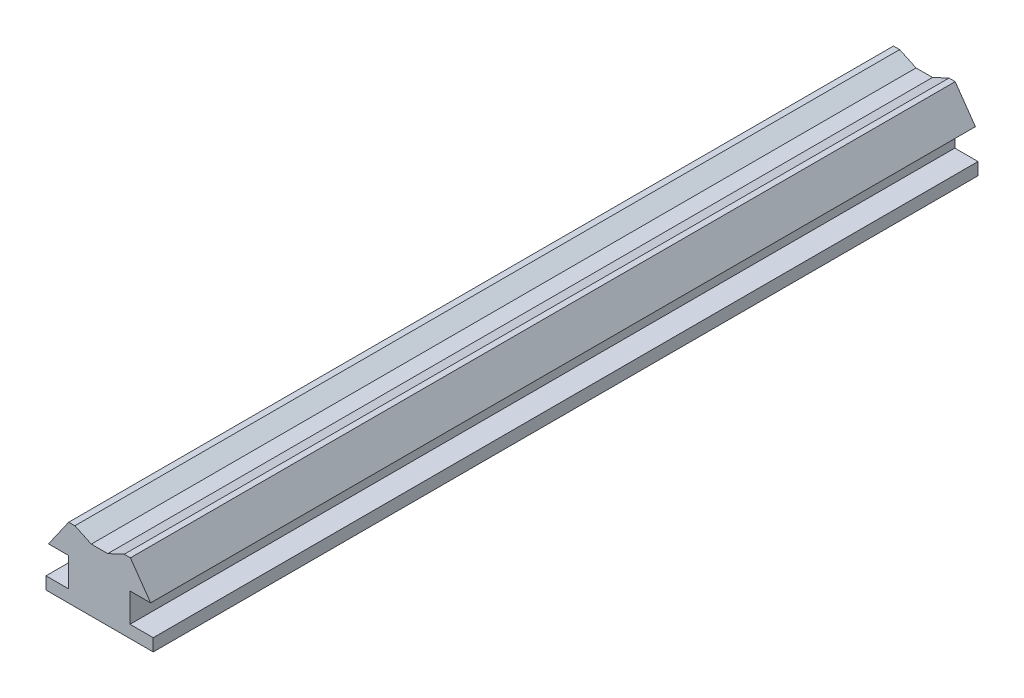
ISO-10303-21;
HEADER;
FILE_DESCRIPTION(('STEP AP214'),'2;1');
FILE_NAME('part.step','',(''),(''),'','','');
FILE_SCHEMA(('AUTOMOTIVE_DESIGN { 1 0 10303 214 1 1 1 1 }'));
ENDSEC;
DATA;
#1=APPLICATION_CONTEXT('core data for automotive mechanical design processes');
#2=APPLICATION_PROTOCOL_DEFINITION('international standard','automotive_design',2000,#1);
#3=PRODUCT_CONTEXT('',#1,'mechanical');
#4=PRODUCT('Part','Part','',(#3));
#5=PRODUCT_RELATED_PRODUCT_CATEGORY('part','',(#4));
#6=PRODUCT_DEFINITION_FORMATION('','',#4);
#7=PRODUCT_DEFINITION_CONTEXT('part definition',#1,'design');
#8=PRODUCT_DEFINITION('design','',#6,#7);
#9=PRODUCT_DEFINITION_SHAPE('','',#8);
#10=(LENGTH_UNIT() NAMED_UNIT(*) SI_UNIT(.MILLI.,.METRE.));
#11=(NAMED_UNIT(*) PLANE_ANGLE_UNIT() SI_UNIT($,.RADIAN.));
#12=(NAMED_UNIT(*) SI_UNIT($,.STERADIAN.) SOLID_ANGLE_UNIT());
#13=UNCERTAINTY_MEASURE_WITH_UNIT(LENGTH_MEASURE(1.E-05),#10,'distance_accuracy_value','');
#14=(GEOMETRIC_REPRESENTATION_CONTEXT(3) GLOBAL_UNCERTAINTY_ASSIGNED_CONTEXT((#13)) GLOBAL_UNIT_ASSIGNED_CONTEXT((#10,
#11,#12)) REPRESENTATION_CONTEXT('',''));
#15=CARTESIAN_POINT('',(0.,0.,0.));
#16=DIRECTION('',(0.,0.,1.));
#17=DIRECTION('',(1.,0.,0.));
#18=AXIS2_PLACEMENT_3D('',#15,#16,#17);
#19=CARTESIAN_POINT('',(0.,-80.3447728525308,2000.));
#20=DIRECTION('',(0.,1.,0.));
#21=DIRECTION('',(0.,0.,1.));
#22=AXIS2_PLACEMENT_3D('',#19,#20,#21);
#23=PLANE('',#22);
#24=DIRECTION('',(1.,0.,0.));
#25=VECTOR('',#24,1.);
#26=CARTESIAN_POINT('',(0.,-80.3447728525308,0.));
#27=LINE('',#26,#25);
#28=CARTESIAN_POINT('',(-160.050058891084,-80.3447728525308,0.));
#29=VERTEX_POINT('',#28);
#30=CARTESIAN_POINT('',(99.9499411089158,-80.3447728525308,0.));
#31=VERTEX_POINT('',#30);
#32=EDGE_CURVE('E177',#29,#31,#27,.T.);
#33=ORIENTED_EDGE('',*,*,#32,.T.);
#34=DIRECTION('',(0.,0.,-1.));
#35=VECTOR('',#34,1.);
#36=CARTESIAN_POINT('',(99.9499411089158,-80.3447728525308,2000.));
#37=LINE('',#36,#35);
#38=CARTESIAN_POINT('',(99.9499411089158,-80.3447728525308,2000.));
#39=VERTEX_POINT('',#38);
#40=EDGE_CURVE('E11',#39,#31,#37,.T.);
#41=ORIENTED_EDGE('',*,*,#40,.F.);
#42=DIRECTION('',(1.,0.,0.));
#43=VECTOR('',#42,1.);
#44=CARTESIAN_POINT('',(0.,-80.3447728525308,2000.));
#45=LINE('',#44,#43);
#46=CARTESIAN_POINT('',(-160.050058891084,-80.3447728525308,2000.));
#47=VERTEX_POINT('',#46);
#48=EDGE_CURVE('E113',#47,#39,#45,.T.);
#49=ORIENTED_EDGE('',*,*,#48,.F.);
#50=DIRECTION('',(0.,0.,-1.));
#51=VECTOR('',#50,1.);
#52=CARTESIAN_POINT('',(-160.050058891084,-80.3447728525308,2000.));
#53=LINE('',#52,#51);
#54=EDGE_CURVE('E173',#47,#29,#53,.T.);
#55=ORIENTED_EDGE('',*,*,#54,.T.);
#56=EDGE_LOOP('',(#33,#41,#49,#55));
#57=FACE_BOUND('',#56,.T.);
#58=ADVANCED_FACE('F33',(#57),#23,.F.);
#59=CARTESIAN_POINT('',(99.9499411089158,0.,2000.));
#60=DIRECTION('',(1.,0.,0.));
#61=DIRECTION('',(0.,1.,0.));
#62=AXIS2_PLACEMENT_3D('',#59,#60,#61);
#63=PLANE('',#62);
#64=DIRECTION('',(0.,-1.,0.));
#65=VECTOR('',#64,1.);
#66=CARTESIAN_POINT('',(99.9499411089158,0.,0.));
#67=LINE('',#66,#65);
#68=CARTESIAN_POINT('',(99.9499411089158,-50.3447728525308,0.));
#69=VERTEX_POINT('',#68);
#70=EDGE_CURVE('E180',#69,#31,#67,.T.);
#71=ORIENTED_EDGE('',*,*,#70,.F.);
#72=DIRECTION('',(0.,0.,-1.));
#73=VECTOR('',#72,1.);
#74=CARTESIAN_POINT('',(99.9499411089158,-50.3447728525308,2000.));
#75=LINE('',#74,#73);
#76=CARTESIAN_POINT('',(99.9499411089158,-50.3447728525308,2000.));
#77=VERTEX_POINT('',#76);
#78=EDGE_CURVE('E41',#77,#69,#75,.T.);
#79=ORIENTED_EDGE('',*,*,#78,.F.);
#80=DIRECTION('',(0.,-1.,0.));
#81=VECTOR('',#80,1.);
#82=CARTESIAN_POINT('',(99.9499411089158,0.,2000.));
#83=LINE('',#82,#81);
#84=EDGE_CURVE('E262',#77,#39,#83,.T.);
#85=ORIENTED_EDGE('',*,*,#84,.T.);
#86=ORIENTED_EDGE('',*,*,#40,.T.);
#87=EDGE_LOOP('',(#71,#79,#85,#86));
#88=FACE_BOUND('',#87,.T.);
#89=ADVANCED_FACE('F249',(#88),#63,.T.);
#90=CARTESIAN_POINT('',(0.,-50.3447728525308,2000.));
#91=DIRECTION('',(0.,1.,0.));
#92=DIRECTION('',(0.,0.,1.));
#93=AXIS2_PLACEMENT_3D('',#90,#91,#92);
#94=PLANE('',#93);
#95=DIRECTION('',(1.,0.,0.));
#96=VECTOR('',#95,1.);
#97=CARTESIAN_POINT('',(0.,-50.3447728525308,0.));
#98=LINE('',#97,#96);
#99=CARTESIAN_POINT('',(43.6687964336795,-50.3447728525308,0.));
#100=VERTEX_POINT('',#99);
#101=EDGE_CURVE('E183',#100,#69,#98,.T.);
#102=ORIENTED_EDGE('',*,*,#101,.F.);
#103=DIRECTION('',(0.,0.,-1.));
#104=VECTOR('',#103,1.);
#105=CARTESIAN_POINT('',(43.6687964336795,-50.3447728525308,2000.));
#106=LINE('',#105,#104);
#107=CARTESIAN_POINT('',(43.6687964336795,-50.3447728525308,2000.));
#108=VERTEX_POINT('',#107);
#109=EDGE_CURVE('E239',#108,#100,#106,.T.);
#110=ORIENTED_EDGE('',*,*,#109,.F.);
#111=DIRECTION('',(1.,0.,0.));
#112=VECTOR('',#111,1.);
#113=CARTESIAN_POINT('',(0.,-50.3447728525308,2000.));
#114=LINE('',#113,#112);
#115=EDGE_CURVE('E246',#108,#77,#114,.T.);
#116=ORIENTED_EDGE('',*,*,#115,.T.);
#117=ORIENTED_EDGE('',*,*,#78,.T.);
#118=EDGE_LOOP('',(#102,#110,#116,#117));
#119=FACE_BOUND('',#118,.T.);
#120=ADVANCED_FACE('F244',(#119),#94,.T.);
#121=CARTESIAN_POINT('',(43.6687964336795,0.,2000.));
#122=DIRECTION('',(1.,0.,0.));
#123=DIRECTION('',(0.,1.,0.));
#124=AXIS2_PLACEMENT_3D('',#121,#122,#123);
#125=PLANE('',#124);
#126=DIRECTION('',(0.,-1.,0.));
#127=VECTOR('',#126,1.);
#128=CARTESIAN_POINT('',(43.6687964336795,0.,0.));
#129=LINE('',#128,#127);
#130=CARTESIAN_POINT('',(43.6687964336795,19.6552271474692,0.));
#131=VERTEX_POINT('',#130);
#132=EDGE_CURVE('E186',#131,#100,#129,.T.);
#133=ORIENTED_EDGE('',*,*,#132,.F.);
#134=DIRECTION('',(0.,0.,-1.));
#135=VECTOR('',#134,1.);
#136=CARTESIAN_POINT('',(43.6687964336795,19.6552271474692,2000.));
#137=LINE('',#136,#135);
#138=CARTESIAN_POINT('',(43.6687964336795,19.6552271474692,2000.));
#139=VERTEX_POINT('',#138);
#140=EDGE_CURVE('E237',#139,#131,#137,.T.);
#141=ORIENTED_EDGE('',*,*,#140,.F.);
#142=DIRECTION('',(0.,-1.,0.));
#143=VECTOR('',#142,1.);
#144=CARTESIAN_POINT('',(43.6687964336795,0.,2000.));
#145=LINE('',#144,#143);
#146=EDGE_CURVE('E259',#139,#108,#145,.T.);
#147=ORIENTED_EDGE('',*,*,#146,.T.);
#148=ORIENTED_EDGE('',*,*,#109,.T.);
#149=EDGE_LOOP('',(#133,#141,#147,#148));
#150=FACE_BOUND('',#149,.T.);
#151=ADVANCED_FACE('F256',(#150),#125,.T.);
#152=CARTESIAN_POINT('',(0.,19.6552271474692,2000.));
#153=DIRECTION('',(0.,-1.,0.));
#154=DIRECTION('',(1.,0.,0.));
#155=AXIS2_PLACEMENT_3D('',#152,#153,#154);
#156=PLANE('',#155);
#157=DIRECTION('',(-1.,0.,0.));
#158=VECTOR('',#157,1.);
#159=CARTESIAN_POINT('',(0.,19.6552271474692,0.));
#160=LINE('',#159,#158);
#161=CARTESIAN_POINT('',(93.6687964336795,19.6552271474692,0.));
#162=VERTEX_POINT('',#161);
#163=EDGE_CURVE('E189',#162,#131,#160,.T.);
#164=ORIENTED_EDGE('',*,*,#163,.F.);
#165=DIRECTION('',(0.,0.,-1.));
#166=VECTOR('',#165,1.);
#167=CARTESIAN_POINT('',(93.6687964336795,19.6552271474692,2000.));
#168=LINE('',#167,#166);
#169=CARTESIAN_POINT('',(93.6687964336795,19.6552271474692,2000.));
#170=VERTEX_POINT('',#169);
#171=EDGE_CURVE('E235',#170,#162,#168,.T.);
#172=ORIENTED_EDGE('',*,*,#171,.F.);
#173=DIRECTION('',(-1.,0.,0.));
#174=VECTOR('',#173,1.);
#175=CARTESIAN_POINT('',(0.,19.6552271474692,2000.));
#176=LINE('',#175,#174);
#177=EDGE_CURVE('E264',#170,#139,#176,.T.);
#178=ORIENTED_EDGE('',*,*,#177,.T.);
#179=ORIENTED_EDGE('',*,*,#140,.T.);
#180=EDGE_LOOP('',(#164,#172,#178,#179));
#181=FACE_BOUND('',#180,.T.);
#182=ADVANCED_FACE('F419',(#181),#156,.T.);
#183=CARTESIAN_POINT('',(72.0876417627088,50.4763101740096,2000.));
#184=DIRECTION('',(0.819152044288993,0.573576436351044,0.));
#185=DIRECTION('',(-0.573576436351044,0.819152044288993,0.));
#186=AXIS2_PLACEMENT_3D('',#183,#184,#185);
#187=PLANE('',#186);
#188=DIRECTION('',(0.573576436351044,-0.819152044288993,0.));
#189=VECTOR('',#188,1.);
#190=CARTESIAN_POINT('',(72.0876417627088,50.4763101740096,0.));
#191=LINE('',#190,#189);
#192=CARTESIAN_POINT('',(44.6058028039926,89.724443704508,0.));
#193=VERTEX_POINT('',#192);
#194=EDGE_CURVE('E192',#193,#162,#191,.T.);
#195=ORIENTED_EDGE('',*,*,#194,.F.);
#196=DIRECTION('',(0.,0.,-1.));
#197=VECTOR('',#196,1.);
#198=CARTESIAN_POINT('',(44.6058028039926,89.724443704508,2000.));
#199=LINE('',#198,#197);
#200=CARTESIAN_POINT('',(44.6058028039926,89.724443704508,2000.));
#201=VERTEX_POINT('',#200);
#202=EDGE_CURVE('E233',#201,#193,#199,.T.);
#203=ORIENTED_EDGE('',*,*,#202,.F.);
#204=DIRECTION('',(0.573576436351044,-0.819152044288993,0.));
#205=VECTOR('',#204,1.);
#206=CARTESIAN_POINT('',(72.0876417627088,50.4763101740096,2000.));
#207=LINE('',#206,#205);
#208=EDGE_CURVE('E270',#201,#170,#207,.T.);
#209=ORIENTED_EDGE('',*,*,#208,.T.);
#210=ORIENTED_EDGE('',*,*,#171,.T.);
#211=EDGE_LOOP('',(#195,#203,#209,#210));
#212=FACE_BOUND('',#211,.T.);
#213=ADVANCED_FACE('F409',(#212),#187,.T.);
#214=CARTESIAN_POINT('',(0.,89.7244437045081,2000.));
#215=DIRECTION('',(0.,1.,0.));
#216=DIRECTION('',(-1.,0.,0.));
#217=AXIS2_PLACEMENT_3D('',#214,#215,#216);
#218=PLANE('',#217);
#219=DIRECTION('',(1.,0.,0.));
#220=VECTOR('',#219,1.);
#221=CARTESIAN_POINT('',(0.,89.7244437045081,0.));
#222=LINE('',#221,#220);
#223=CARTESIAN_POINT('',(29.6058028039926,89.724443704508,0.));
#224=VERTEX_POINT('',#223);
#225=EDGE_CURVE('E195',#224,#193,#222,.T.);
#226=ORIENTED_EDGE('',*,*,#225,.F.);
#227=DIRECTION('',(0.,0.,-1.));
#228=VECTOR('',#227,1.);
#229=CARTESIAN_POINT('',(29.6058028039926,89.724443704508,2000.));
#230=LINE('',#229,#228);
#231=CARTESIAN_POINT('',(29.6058028039926,89.724443704508,2000.));
#232=VERTEX_POINT('',#231);
#233=EDGE_CURVE('E231',#232,#224,#230,.T.);
#234=ORIENTED_EDGE('',*,*,#233,.F.);
#235=DIRECTION('',(1.,0.,0.));
#236=VECTOR('',#235,1.);
#237=CARTESIAN_POINT('',(0.,89.7244437045081,2000.));
#238=LINE('',#237,#236);
#239=EDGE_CURVE('E273',#232,#201,#238,.T.);
#240=ORIENTED_EDGE('',*,*,#239,.T.);
#241=ORIENTED_EDGE('',*,*,#202,.T.);
#242=EDGE_LOOP('',(#226,#234,#240,#241));
#243=FACE_BOUND('',#242,.T.);
#244=ADVANCED_FACE('F399',(#243),#218,.T.);
#245=CARTESIAN_POINT('',(-29.0786759625082,62.3594218408548,2000.));
#246=DIRECTION('',(0.422618261740694,-0.906307787036653,0.));
#247=DIRECTION('',(0.906307787036653,0.422618261740694,0.));
#248=AXIS2_PLACEMENT_3D('',#245,#246,#247);
#249=PLANE('',#248);
#250=DIRECTION('',(-0.906307787036653,-0.422618261740694,0.));
#251=VECTOR('',#250,1.);
#252=CARTESIAN_POINT('',(-29.0786759625082,62.3594218408548,0.));
#253=LINE('',#252,#251);
#254=CARTESIAN_POINT('',(-10.290144877016,71.1206577715029,0.));
#255=VERTEX_POINT('',#254);
#256=EDGE_CURVE('E198',#224,#255,#253,.T.);
#257=ORIENTED_EDGE('',*,*,#256,.T.);
#258=DIRECTION('',(0.,0.,-1.));
#259=VECTOR('',#258,1.);
#260=CARTESIAN_POINT('',(-10.290144877016,71.1206577715029,2000.));
#261=LINE('',#260,#259);
#262=CARTESIAN_POINT('',(-10.290144877016,71.1206577715029,2000.));
#263=VERTEX_POINT('',#262);
#264=EDGE_CURVE('E229',#263,#255,#261,.T.);
#265=ORIENTED_EDGE('',*,*,#264,.F.);
#266=DIRECTION('',(-0.906307787036653,-0.422618261740694,0.));
#267=VECTOR('',#266,1.);
#268=CARTESIAN_POINT('',(-29.0786759625082,62.3594218408548,2000.));
#269=LINE('',#268,#267);
#270=EDGE_CURVE('E276',#232,#263,#269,.T.);
#271=ORIENTED_EDGE('',*,*,#270,.F.);
#272=ORIENTED_EDGE('',*,*,#233,.T.);
#273=EDGE_LOOP('',(#257,#265,#271,#272));
#274=FACE_BOUND('',#273,.T.);
#275=ADVANCED_FACE('F389',(#274),#249,.F.);
#276=CARTESIAN_POINT('',(0.,71.1206577715029,2000.));
#277=DIRECTION('',(0.,1.,0.));
#278=DIRECTION('',(0.,0.,1.));
#279=AXIS2_PLACEMENT_3D('',#276,#277,#278);
#280=PLANE('',#279);
#281=DIRECTION('',(1.,0.,0.));
#282=VECTOR('',#281,1.);
#283=CARTESIAN_POINT('',(0.,71.1206577715029,0.));
#284=LINE('',#283,#282);
#285=CARTESIAN_POINT('',(-50.2221280435459,71.1206577715029,0.));
#286=VERTEX_POINT('',#285);
#287=EDGE_CURVE('E201',#286,#255,#284,.T.);
#288=ORIENTED_EDGE('',*,*,#287,.F.);
#289=DIRECTION('',(0.,0.,-1.));
#290=VECTOR('',#289,1.);
#291=CARTESIAN_POINT('',(-50.2221280435459,71.1206577715029,2000.));
#292=LINE('',#291,#290);
#293=CARTESIAN_POINT('',(-50.2221280435459,71.1206577715029,2000.));
#294=VERTEX_POINT('',#293);
#295=EDGE_CURVE('E227',#294,#286,#292,.T.);
#296=ORIENTED_EDGE('',*,*,#295,.F.);
#297=DIRECTION('',(1.,0.,0.));
#298=VECTOR('',#297,1.);
#299=CARTESIAN_POINT('',(0.,71.1206577715029,2000.));
#300=LINE('',#299,#298);
#301=EDGE_CURVE('E278',#294,#263,#300,.T.);
#302=ORIENTED_EDGE('',*,*,#301,.T.);
#303=ORIENTED_EDGE('',*,*,#264,.T.);
#304=EDGE_LOOP('',(#288,#296,#302,#303));
#305=FACE_BOUND('',#304,.T.);
#306=ADVANCED_FACE('F379',(#305),#280,.T.);
#307=CARTESIAN_POINT('',(18.2708091358813,39.1818766352067,2000.));
#308=DIRECTION('',(0.4226182617407,0.90630778703665,0.));
#309=DIRECTION('',(-0.90630778703665,0.4226182617407,0.));
#310=AXIS2_PLACEMENT_3D('',#307,#308,#309);
#311=PLANE('',#310);
#312=DIRECTION('',(0.90630778703665,-0.4226182617407,0.));
#313=VECTOR('',#312,1.);
#314=CARTESIAN_POINT('',(18.2708091358813,39.1818766352067,0.));
#315=LINE('',#314,#313);
#316=CARTESIAN_POINT('',(-90.0500588910842,89.6927269341778,0.));
#317=VERTEX_POINT('',#316);
#318=EDGE_CURVE('E204',#317,#286,#315,.T.);
#319=ORIENTED_EDGE('',*,*,#318,.F.);
#320=DIRECTION('',(0.,0.,-1.));
#321=VECTOR('',#320,1.);
#322=CARTESIAN_POINT('',(-90.0500588910842,89.6927269341778,2000.));
#323=LINE('',#322,#321);
#324=CARTESIAN_POINT('',(-90.0500588910842,89.6927269341778,2000.));
#325=VERTEX_POINT('',#324);
#326=EDGE_CURVE('E225',#325,#317,#323,.T.);
#327=ORIENTED_EDGE('',*,*,#326,.F.);
#328=DIRECTION('',(0.90630778703665,-0.4226182617407,0.));
#329=VECTOR('',#328,1.);
#330=CARTESIAN_POINT('',(18.2708091358813,39.1818766352067,2000.));
#331=LINE('',#330,#329);
#332=EDGE_CURVE('E281',#325,#294,#331,.T.);
#333=ORIENTED_EDGE('',*,*,#332,.T.);
#334=ORIENTED_EDGE('',*,*,#295,.T.);
#335=EDGE_LOOP('',(#319,#327,#333,#334));
#336=FACE_BOUND('',#335,.T.);
#337=ADVANCED_FACE('F370',(#336),#311,.T.);
#338=CARTESIAN_POINT('',(0.,89.6927269341778,2000.));
#339=DIRECTION('',(0.,-1.,0.));
#340=DIRECTION('',(0.,0.,-1.));
#341=AXIS2_PLACEMENT_3D('',#338,#339,#340);
#342=PLANE('',#341);
#343=DIRECTION('',(-1.,0.,0.));
#344=VECTOR('',#343,1.);
#345=CARTESIAN_POINT('',(0.,89.6927269341778,0.));
#346=LINE('',#345,#344);
#347=CARTESIAN_POINT('',(-105.050058891084,89.6927269341778,0.));
#348=VERTEX_POINT('',#347);
#349=EDGE_CURVE('E207',#317,#348,#346,.T.);
#350=ORIENTED_EDGE('',*,*,#349,.T.);
#351=DIRECTION('',(0.,0.,-1.));
#352=VECTOR('',#351,1.);
#353=CARTESIAN_POINT('',(-105.050058891084,89.6927269341778,2000.));
#354=LINE('',#353,#352);
#355=CARTESIAN_POINT('',(-105.050058891084,89.6927269341778,2000.));
#356=VERTEX_POINT('',#355);
#357=EDGE_CURVE('E223',#356,#348,#354,.T.);
#358=ORIENTED_EDGE('',*,*,#357,.F.);
#359=DIRECTION('',(-1.,0.,0.));
#360=VECTOR('',#359,1.);
#361=CARTESIAN_POINT('',(0.,89.6927269341778,2000.));
#362=LINE('',#361,#360);
#363=EDGE_CURVE('E284',#325,#356,#362,.T.);
#364=ORIENTED_EDGE('',*,*,#363,.F.);
#365=ORIENTED_EDGE('',*,*,#326,.T.);
#366=EDGE_LOOP('',(#350,#358,#364,#365));
#367=FACE_BOUND('',#366,.T.);
#368=ADVANCED_FACE('F296',(#367),#342,.F.);
#369=CARTESIAN_POINT('',(-112.631444363797,78.8653863829792,2000.));
#370=DIRECTION('',(-0.819152044288989,0.57357643635105,0.));
#371=DIRECTION('',(-0.57357643635105,-0.819152044288989,0.));
#372=AXIS2_PLACEMENT_3D('',#369,#370,#371);
#373=PLANE('',#372);
#374=DIRECTION('',(0.57357643635105,0.819152044288989,0.));
#375=VECTOR('',#374,1.);
#376=CARTESIAN_POINT('',(-112.631444363797,78.8653863829792,0.));
#377=LINE('',#376,#375);
#378=CARTESIAN_POINT('',(-154.090844199099,19.6552271474692,0.));
#379=VERTEX_POINT('',#378);
#380=EDGE_CURVE('E210',#379,#348,#377,.T.);
#381=ORIENTED_EDGE('',*,*,#380,.F.);
#382=DIRECTION('',(0.,0.,-1.));
#383=VECTOR('',#382,1.);
#384=CARTESIAN_POINT('',(-154.090844199099,19.6552271474692,2000.));
#385=LINE('',#384,#383);
#386=CARTESIAN_POINT('',(-154.090844199099,19.6552271474692,2000.));
#387=VERTEX_POINT('',#386);
#388=EDGE_CURVE('E221',#387,#379,#385,.T.);
#389=ORIENTED_EDGE('',*,*,#388,.F.);
#390=DIRECTION('',(0.57357643635105,0.819152044288989,0.));
#391=VECTOR('',#390,1.);
#392=CARTESIAN_POINT('',(-112.631444363797,78.8653863829792,2000.));
#393=LINE('',#392,#391);
#394=EDGE_CURVE('E286',#387,#356,#393,.T.);
#395=ORIENTED_EDGE('',*,*,#394,.T.);
#396=ORIENTED_EDGE('',*,*,#357,.T.);
#397=EDGE_LOOP('',(#381,#389,#395,#396));
#398=FACE_BOUND('',#397,.T.);
#399=ADVANCED_FACE('F290',(#398),#373,.T.);
#400=CARTESIAN_POINT('',(0.,19.6552271474692,2000.));
#401=DIRECTION('',(0.,1.,0.));
#402=DIRECTION('',(0.,0.,1.));
#403=AXIS2_PLACEMENT_3D('',#400,#401,#402);
#404=PLANE('',#403);
#405=DIRECTION('',(1.,0.,0.));
#406=VECTOR('',#405,1.);
#407=CARTESIAN_POINT('',(0.,19.6552271474692,0.));
#408=LINE('',#407,#406);
#409=CARTESIAN_POINT('',(-105.210977602892,19.6552271474692,0.));
#410=VERTEX_POINT('',#409);
#411=EDGE_CURVE('E213',#379,#410,#408,.T.);
#412=ORIENTED_EDGE('',*,*,#411,.T.);
#413=DIRECTION('',(0.,0.,-1.));
#414=VECTOR('',#413,1.);
#415=CARTESIAN_POINT('',(-105.210977602892,19.6552271474692,2000.));
#416=LINE('',#415,#414);
#417=CARTESIAN_POINT('',(-105.210977602892,19.6552271474692,2000.));
#418=VERTEX_POINT('',#417);
#419=EDGE_CURVE('E168',#418,#410,#416,.T.);
#420=ORIENTED_EDGE('',*,*,#419,.F.);
#421=DIRECTION('',(1.,0.,0.));
#422=VECTOR('',#421,1.);
#423=CARTESIAN_POINT('',(0.,19.6552271474692,2000.));
#424=LINE('',#423,#422);
#425=EDGE_CURVE('E159',#387,#418,#424,.T.);
#426=ORIENTED_EDGE('',*,*,#425,.F.);
#427=ORIENTED_EDGE('',*,*,#388,.T.);
#428=EDGE_LOOP('',(#412,#420,#426,#427));
#429=FACE_BOUND('',#428,.T.);
#430=ADVANCED_FACE('F301',(#429),#404,.F.);
#431=CARTESIAN_POINT('',(-105.210977602892,0.,2000.));
#432=DIRECTION('',(1.,0.,0.));
#433=DIRECTION('',(0.,1.,0.));
#434=AXIS2_PLACEMENT_3D('',#431,#432,#433);
#435=PLANE('',#434);
#436=DIRECTION('',(0.,-1.,0.));
#437=VECTOR('',#436,1.);
#438=CARTESIAN_POINT('',(-105.210977602892,0.,0.));
#439=LINE('',#438,#437);
#440=CARTESIAN_POINT('',(-105.210977602892,-50.3447728525308,0.));
#441=VERTEX_POINT('',#440);
#442=EDGE_CURVE('E167',#410,#441,#439,.T.);
#443=ORIENTED_EDGE('',*,*,#442,.T.);
#444=DIRECTION('',(0.,0.,-1.));
#445=VECTOR('',#444,1.);
#446=CARTESIAN_POINT('',(-105.210977602892,-50.3447728525308,2000.));
#447=LINE('',#446,#445);
#448=CARTESIAN_POINT('',(-105.210977602892,-50.3447728525308,2000.));
#449=VERTEX_POINT('',#448);
#450=EDGE_CURVE('E164',#449,#441,#447,.T.);
#451=ORIENTED_EDGE('',*,*,#450,.F.);
#452=DIRECTION('',(0.,-1.,0.));
#453=VECTOR('',#452,1.);
#454=CARTESIAN_POINT('',(-105.210977602892,0.,2000.));
#455=LINE('',#454,#453);
#456=EDGE_CURVE('E152',#418,#449,#455,.T.);
#457=ORIENTED_EDGE('',*,*,#456,.F.);
#458=ORIENTED_EDGE('',*,*,#419,.T.);
#459=EDGE_LOOP('',(#443,#451,#457,#458));
#460=FACE_BOUND('',#459,.T.);
#461=ADVANCED_FACE('F165',(#460),#435,.F.);
#462=CARTESIAN_POINT('',(0.,-50.3447728525308,2000.));
#463=DIRECTION('',(0.,-1.,0.));
#464=DIRECTION('',(0.,0.,-1.));
#465=AXIS2_PLACEMENT_3D('',#462,#463,#464);
#466=PLANE('',#465);
#467=DIRECTION('',(-1.,0.,0.));
#468=VECTOR('',#467,1.);
#469=CARTESIAN_POINT('',(0.,-50.3447728525308,0.));
#470=LINE('',#469,#468);
#471=CARTESIAN_POINT('',(-160.050058891084,-50.3447728525308,0.));
#472=VERTEX_POINT('',#471);
#473=EDGE_CURVE('E101',#441,#472,#470,.T.);
#474=ORIENTED_EDGE('',*,*,#473,.T.);
#475=DIRECTION('',(0.,0.,-1.));
#476=VECTOR('',#475,1.);
#477=CARTESIAN_POINT('',(-160.050058891084,-50.3447728525308,2000.));
#478=LINE('',#477,#476);
#479=CARTESIAN_POINT('',(-160.050058891084,-50.3447728525308,2000.));
#480=VERTEX_POINT('',#479);
#481=EDGE_CURVE('E169',#480,#472,#478,.T.);
#482=ORIENTED_EDGE('',*,*,#481,.F.);
#483=DIRECTION('',(-1.,0.,0.));
#484=VECTOR('',#483,1.);
#485=CARTESIAN_POINT('',(0.,-50.3447728525308,2000.));
#486=LINE('',#485,#484);
#487=EDGE_CURVE('E156',#449,#480,#486,.T.);
#488=ORIENTED_EDGE('',*,*,#487,.F.);
#489=ORIENTED_EDGE('',*,*,#450,.T.);
#490=EDGE_LOOP('',(#474,#482,#488,#489));
#491=FACE_BOUND('',#490,.T.);
#492=ADVANCED_FACE('F171',(#491),#466,.F.);
#493=CARTESIAN_POINT('',(-160.050058891084,0.,2000.));
#494=DIRECTION('',(1.,0.,0.));
#495=DIRECTION('',(0.,0.,-1.));
#496=AXIS2_PLACEMENT_3D('',#493,#494,#495);
#497=PLANE('',#496);
#498=DIRECTION('',(0.,-1.,0.));
#499=VECTOR('',#498,1.);
#500=CARTESIAN_POINT('',(-160.050058891084,0.,0.));
#501=LINE('',#500,#499);
#502=EDGE_CURVE('E107',#472,#29,#501,.T.);
#503=ORIENTED_EDGE('',*,*,#502,.T.);
#504=ORIENTED_EDGE('',*,*,#54,.F.);
#505=DIRECTION('',(0.,-1.,0.));
#506=VECTOR('',#505,1.);
#507=CARTESIAN_POINT('',(-160.050058891084,0.,2000.));
#508=LINE('',#507,#506);
#509=EDGE_CURVE('E49',#480,#47,#508,.T.);
#510=ORIENTED_EDGE('',*,*,#509,.F.);
#511=ORIENTED_EDGE('',*,*,#481,.T.);
#512=EDGE_LOOP('',(#503,#504,#510,#511));
#513=FACE_BOUND('',#512,.T.);
#514=ADVANCED_FACE('F315',(#513),#497,.F.);
#515=CARTESIAN_POINT('',(0.,0.,2000.));
#516=DIRECTION('',(0.,0.,1.));
#517=DIRECTION('',(1.,0.,0.));
#518=AXIS2_PLACEMENT_3D('',#515,#516,#517);
#519=PLANE('',#518);
#520=ORIENTED_EDGE('',*,*,#48,.T.);
#521=ORIENTED_EDGE('',*,*,#84,.F.);
#522=ORIENTED_EDGE('',*,*,#115,.F.);
#523=ORIENTED_EDGE('',*,*,#146,.F.);
#524=ORIENTED_EDGE('',*,*,#177,.F.);
#525=ORIENTED_EDGE('',*,*,#208,.F.);
#526=ORIENTED_EDGE('',*,*,#239,.F.);
#527=ORIENTED_EDGE('',*,*,#270,.T.);
#528=ORIENTED_EDGE('',*,*,#301,.F.);
#529=ORIENTED_EDGE('',*,*,#332,.F.);
#530=ORIENTED_EDGE('',*,*,#363,.T.);
#531=ORIENTED_EDGE('',*,*,#394,.F.);
#532=ORIENTED_EDGE('',*,*,#425,.T.);
#533=ORIENTED_EDGE('',*,*,#456,.T.);
#534=ORIENTED_EDGE('',*,*,#487,.T.);
#535=ORIENTED_EDGE('',*,*,#509,.T.);
#536=EDGE_LOOP('',(#520,#521,#522,#523,#524,#525,#526,#527,#528,#529,#530,#531,#532,#533,#534,#535));
#537=FACE_BOUND('',#536,.T.);
#538=ADVANCED_FACE('F154',(#537),#519,.T.);
#539=CARTESIAN_POINT('',(0.,0.,0.));
#540=DIRECTION('',(0.,0.,1.));
#541=DIRECTION('',(1.,0.,0.));
#542=AXIS2_PLACEMENT_3D('',#539,#540,#541);
#543=PLANE('',#542);
#544=ORIENTED_EDGE('',*,*,#32,.F.);
#545=ORIENTED_EDGE('',*,*,#502,.F.);
#546=ORIENTED_EDGE('',*,*,#473,.F.);
#547=ORIENTED_EDGE('',*,*,#442,.F.);
#548=ORIENTED_EDGE('',*,*,#411,.F.);
#549=ORIENTED_EDGE('',*,*,#380,.T.);
#550=ORIENTED_EDGE('',*,*,#349,.F.);
#551=ORIENTED_EDGE('',*,*,#318,.T.);
#552=ORIENTED_EDGE('',*,*,#287,.T.);
#553=ORIENTED_EDGE('',*,*,#256,.F.);
#554=ORIENTED_EDGE('',*,*,#225,.T.);
#555=ORIENTED_EDGE('',*,*,#194,.T.);
#556=ORIENTED_EDGE('',*,*,#163,.T.);
#557=ORIENTED_EDGE('',*,*,#132,.T.);
#558=ORIENTED_EDGE('',*,*,#101,.T.);
#559=ORIENTED_EDGE('',*,*,#70,.T.);
#560=EDGE_LOOP('',(#544,#545,#546,#547,#548,#549,#550,#551,#552,#553,#554,#555,#556,#557,#558,#559));
#561=FACE_BOUND('',#560,.T.);
#562=ADVANCED_FACE('F252',(#561),#543,.F.);
#563=CLOSED_SHELL('',(#58,#89,#120,#151,#182,#213,#244,#275,#306,#337,#368,#399,#430,#461,#492,
#514,#538,#562));
#564=MANIFOLD_SOLID_BREP('B2',#563);
#565=ADVANCED_BREP_SHAPE_REPRESENTATION('',(#18,#564),#14);
#566=SHAPE_DEFINITION_REPRESENTATION(#9,#565);
ENDSEC;
END-ISO-10303-21;
